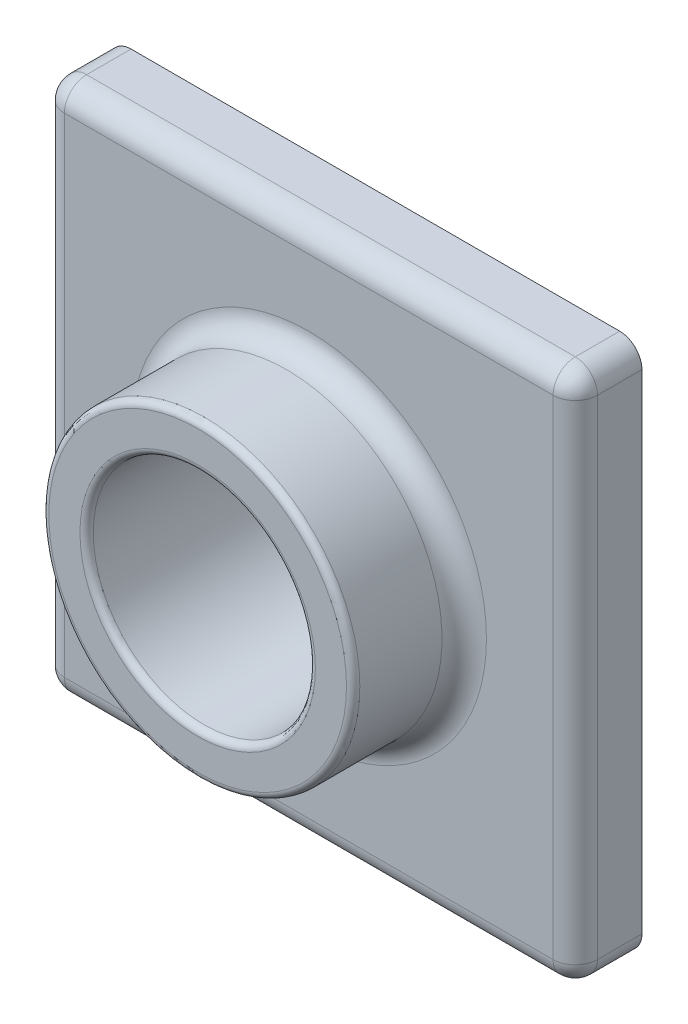
ISO-10303-21;
HEADER;
FILE_DESCRIPTION(('STEP AP214'),'2;1');
FILE_NAME('part.step','',(''),(''),'','','');
FILE_SCHEMA(('AUTOMOTIVE_DESIGN { 1 0 10303 214 1 1 1 1 }'));
ENDSEC;
DATA;
#1=APPLICATION_CONTEXT('core data for automotive mechanical design processes');
#2=APPLICATION_PROTOCOL_DEFINITION('international standard','automotive_design',2000,#1);
#3=PRODUCT_CONTEXT('',#1,'mechanical');
#4=PRODUCT('Part','Part','',(#3));
#5=PRODUCT_RELATED_PRODUCT_CATEGORY('part','',(#4));
#6=PRODUCT_DEFINITION_FORMATION('','',#4);
#7=PRODUCT_DEFINITION_CONTEXT('part definition',#1,'design');
#8=PRODUCT_DEFINITION('design','',#6,#7);
#9=PRODUCT_DEFINITION_SHAPE('','',#8);
#10=(LENGTH_UNIT() NAMED_UNIT(*) SI_UNIT(.MILLI.,.METRE.));
#11=(NAMED_UNIT(*) PLANE_ANGLE_UNIT() SI_UNIT($,.RADIAN.));
#12=(NAMED_UNIT(*) SI_UNIT($,.STERADIAN.) SOLID_ANGLE_UNIT());
#13=UNCERTAINTY_MEASURE_WITH_UNIT(LENGTH_MEASURE(1.E-05),#10,'distance_accuracy_value','');
#14=(GEOMETRIC_REPRESENTATION_CONTEXT(3) GLOBAL_UNCERTAINTY_ASSIGNED_CONTEXT((#13)) GLOBAL_UNIT_ASSIGNED_CONTEXT((#10,
#11,#12)) REPRESENTATION_CONTEXT('',''));
#15=CARTESIAN_POINT('',(0.,0.,0.));
#16=DIRECTION('',(0.,0.,1.));
#17=DIRECTION('',(1.,0.,0.));
#18=AXIS2_PLACEMENT_3D('',#15,#16,#17);
#19=CARTESIAN_POINT('',(0.,0.,0.));
#20=DIRECTION('',(0.,0.,-1.));
#21=DIRECTION('',(-1.,0.,0.));
#22=AXIS2_PLACEMENT_3D('',#19,#20,#21);
#23=PLANE('',#22);
#24=DIRECTION('',(1.,0.,0.));
#25=VECTOR('',#24,1.);
#26=CARTESIAN_POINT('',(0.,0.,0.));
#27=LINE('',#26,#25);
#28=CARTESIAN_POINT('',(5.,0.,0.));
#29=VERTEX_POINT('',#28);
#30=CARTESIAN_POINT('',(115.,0.,0.));
#31=VERTEX_POINT('',#30);
#32=EDGE_CURVE('E300',#29,#31,#27,.T.);
#33=ORIENTED_EDGE('',*,*,#32,.F.);
#34=CARTESIAN_POINT('',(5.,5.,0.));
#35=DIRECTION('',(0.,0.,-1.));
#36=DIRECTION('',(-1.,0.,0.));
#37=AXIS2_PLACEMENT_3D('',#34,#35,#36);
#38=CIRCLE('',#37,5.);
#39=CARTESIAN_POINT('',(0.,5.,0.));
#40=VERTEX_POINT('',#39);
#41=EDGE_CURVE('E354',#29,#40,#38,.T.);
#42=ORIENTED_EDGE('',*,*,#41,.T.);
#43=DIRECTION('',(0.,-1.,0.));
#44=VECTOR('',#43,1.);
#45=CARTESIAN_POINT('',(0.,0.,0.));
#46=LINE('',#45,#44);
#47=CARTESIAN_POINT('',(0.,115.,0.));
#48=VERTEX_POINT('',#47);
#49=EDGE_CURVE('E297',#48,#40,#46,.T.);
#50=ORIENTED_EDGE('',*,*,#49,.F.);
#51=CARTESIAN_POINT('',(5.,115.,0.));
#52=DIRECTION('',(0.,0.,-1.));
#53=DIRECTION('',(-1.,0.,0.));
#54=AXIS2_PLACEMENT_3D('',#51,#52,#53);
#55=CIRCLE('',#54,5.);
#56=CARTESIAN_POINT('',(5.,120.,0.));
#57=VERTEX_POINT('',#56);
#58=EDGE_CURVE('E348',#48,#57,#55,.T.);
#59=ORIENTED_EDGE('',*,*,#58,.T.);
#60=DIRECTION('',(-1.,0.,0.));
#61=VECTOR('',#60,1.);
#62=CARTESIAN_POINT('',(0.,120.,0.));
#63=LINE('',#62,#61);
#64=CARTESIAN_POINT('',(115.,120.,0.));
#65=VERTEX_POINT('',#64);
#66=EDGE_CURVE('E306',#65,#57,#63,.T.);
#67=ORIENTED_EDGE('',*,*,#66,.F.);
#68=CARTESIAN_POINT('',(115.,115.,0.));
#69=DIRECTION('',(0.,0.,-1.));
#70=DIRECTION('',(-1.,0.,0.));
#71=AXIS2_PLACEMENT_3D('',#68,#69,#70);
#72=CIRCLE('',#71,5.);
#73=CARTESIAN_POINT('',(120.,115.,0.));
#74=VERTEX_POINT('',#73);
#75=EDGE_CURVE('E350',#65,#74,#72,.T.);
#76=ORIENTED_EDGE('',*,*,#75,.T.);
#77=DIRECTION('',(0.,1.,0.));
#78=VECTOR('',#77,1.);
#79=CARTESIAN_POINT('',(120.,0.,0.));
#80=LINE('',#79,#78);
#81=CARTESIAN_POINT('',(120.,5.,0.));
#82=VERTEX_POINT('',#81);
#83=EDGE_CURVE('E303',#82,#74,#80,.T.);
#84=ORIENTED_EDGE('',*,*,#83,.F.);
#85=CARTESIAN_POINT('',(115.,5.,0.));
#86=DIRECTION('',(0.,0.,-1.));
#87=DIRECTION('',(-1.,0.,0.));
#88=AXIS2_PLACEMENT_3D('',#85,#86,#87);
#89=CIRCLE('',#88,5.);
#90=EDGE_CURVE('E352',#82,#31,#89,.T.);
#91=ORIENTED_EDGE('',*,*,#90,.T.);
#92=EDGE_LOOP('',(#33,#42,#50,#59,#67,#76,#84,#91));
#93=FACE_BOUND('',#92,.T.);
#94=CARTESIAN_POINT('',(5.,5.,0.));
#95=DIRECTION('',(0.,0.,-1.));
#96=DIRECTION('',(-1.,0.,0.));
#97=AXIS2_PLACEMENT_3D('',#94,#95,#96);
#98=CIRCLE('',#97,3.);
#99=CARTESIAN_POINT('',(5.,2.,0.));
#100=VERTEX_POINT('',#99);
#101=CARTESIAN_POINT('',(2.,5.,0.));
#102=VERTEX_POINT('',#101);
#103=EDGE_CURVE('E227',#100,#102,#98,.T.);
#104=ORIENTED_EDGE('',*,*,#103,.F.);
#105=DIRECTION('',(1.,0.,0.));
#106=VECTOR('',#105,1.);
#107=CARTESIAN_POINT('',(0.,2.,0.));
#108=LINE('',#107,#106);
#109=CARTESIAN_POINT('',(115.,2.,0.));
#110=VERTEX_POINT('',#109);
#111=EDGE_CURVE('E280',#100,#110,#108,.T.);
#112=ORIENTED_EDGE('',*,*,#111,.T.);
#113=CARTESIAN_POINT('',(115.,5.,0.));
#114=DIRECTION('',(0.,0.,-1.));
#115=DIRECTION('',(-1.,0.,0.));
#116=AXIS2_PLACEMENT_3D('',#113,#114,#115);
#117=CIRCLE('',#116,3.);
#118=CARTESIAN_POINT('',(118.,5.,0.));
#119=VERTEX_POINT('',#118);
#120=EDGE_CURVE('E284',#119,#110,#117,.T.);
#121=ORIENTED_EDGE('',*,*,#120,.F.);
#122=DIRECTION('',(0.,1.,0.));
#123=VECTOR('',#122,1.);
#124=CARTESIAN_POINT('',(118.,0.,0.));
#125=LINE('',#124,#123);
#126=CARTESIAN_POINT('',(118.,115.,0.));
#127=VERTEX_POINT('',#126);
#128=EDGE_CURVE('E51',#119,#127,#125,.T.);
#129=ORIENTED_EDGE('',*,*,#128,.T.);
#130=CARTESIAN_POINT('',(115.,115.,0.));
#131=DIRECTION('',(0.,0.,-1.));
#132=DIRECTION('',(-1.,0.,0.));
#133=AXIS2_PLACEMENT_3D('',#130,#131,#132);
#134=CIRCLE('',#133,3.);
#135=CARTESIAN_POINT('',(115.,118.,0.));
#136=VERTEX_POINT('',#135);
#137=EDGE_CURVE('E288',#136,#127,#134,.T.);
#138=ORIENTED_EDGE('',*,*,#137,.F.);
#139=DIRECTION('',(-1.,0.,0.));
#140=VECTOR('',#139,1.);
#141=CARTESIAN_POINT('',(0.,118.,0.));
#142=LINE('',#141,#140);
#143=CARTESIAN_POINT('',(5.,118.,0.));
#144=VERTEX_POINT('',#143);
#145=EDGE_CURVE('E222',#136,#144,#142,.T.);
#146=ORIENTED_EDGE('',*,*,#145,.T.);
#147=CARTESIAN_POINT('',(5.,115.,0.));
#148=DIRECTION('',(0.,0.,-1.));
#149=DIRECTION('',(-1.,0.,0.));
#150=AXIS2_PLACEMENT_3D('',#147,#148,#149);
#151=CIRCLE('',#150,3.);
#152=CARTESIAN_POINT('',(2.,115.,0.));
#153=VERTEX_POINT('',#152);
#154=EDGE_CURVE('E268',#153,#144,#151,.T.);
#155=ORIENTED_EDGE('',*,*,#154,.F.);
#156=DIRECTION('',(0.,-1.,0.));
#157=VECTOR('',#156,1.);
#158=CARTESIAN_POINT('',(2.,0.,0.));
#159=LINE('',#158,#157);
#160=EDGE_CURVE('E279',#153,#102,#159,.T.);
#161=ORIENTED_EDGE('',*,*,#160,.T.);
#162=EDGE_LOOP('',(#104,#112,#121,#129,#138,#146,#155,#161));
#163=FACE_BOUND('',#162,.T.);
#164=ADVANCED_FACE('F36',(#93,#163),#23,.T.);
#165=CARTESIAN_POINT('',(0.,0.,15.));
#166=DIRECTION('',(0.,0.,-1.));
#167=DIRECTION('',(-1.,0.,0.));
#168=AXIS2_PLACEMENT_3D('',#165,#166,#167);
#169=PLANE('',#168);
#170=CARTESIAN_POINT('',(60.,60.,15.));
#171=DIRECTION('',(0.,0.,-1.));
#172=DIRECTION('',(-1.,0.,0.));
#173=AXIS2_PLACEMENT_3D('',#170,#171,#172);
#174=CIRCLE('',#173,40.);
#175=CARTESIAN_POINT('',(20.,60.,15.));
#176=VERTEX_POINT('',#175);
#177=EDGE_CURVE('E321',#176,#176,#174,.T.);
#178=ORIENTED_EDGE('',*,*,#177,.T.);
#179=EDGE_LOOP('',(#178));
#180=FACE_BOUND('',#179,.T.);
#181=DIRECTION('',(0.,1.,0.));
#182=VECTOR('',#181,1.);
#183=CARTESIAN_POINT('',(115.,0.,15.));
#184=LINE('',#183,#182);
#185=CARTESIAN_POINT('',(115.,5.,15.));
#186=VERTEX_POINT('',#185);
#187=CARTESIAN_POINT('',(115.,115.,15.));
#188=VERTEX_POINT('',#187);
#189=EDGE_CURVE('E316',#186,#188,#184,.T.);
#190=ORIENTED_EDGE('',*,*,#189,.T.);
#191=DIRECTION('',(-1.,0.,0.));
#192=VECTOR('',#191,1.);
#193=CARTESIAN_POINT('',(0.,115.,15.));
#194=LINE('',#193,#192);
#195=CARTESIAN_POINT('',(5.,115.,15.));
#196=VERTEX_POINT('',#195);
#197=EDGE_CURVE('E318',#188,#196,#194,.T.);
#198=ORIENTED_EDGE('',*,*,#197,.T.);
#199=DIRECTION('',(0.,-1.,0.));
#200=VECTOR('',#199,1.);
#201=CARTESIAN_POINT('',(5.,0.,15.));
#202=LINE('',#201,#200);
#203=CARTESIAN_POINT('',(5.,5.,15.));
#204=VERTEX_POINT('',#203);
#205=EDGE_CURVE('E312',#196,#204,#202,.T.);
#206=ORIENTED_EDGE('',*,*,#205,.T.);
#207=DIRECTION('',(1.,0.,0.));
#208=VECTOR('',#207,1.);
#209=CARTESIAN_POINT('',(0.,5.,15.));
#210=LINE('',#209,#208);
#211=EDGE_CURVE('E314',#204,#186,#210,.T.);
#212=ORIENTED_EDGE('',*,*,#211,.T.);
#213=EDGE_LOOP('',(#190,#198,#206,#212));
#214=FACE_BOUND('',#213,.T.);
#215=ADVANCED_FACE('F438',(#180,#214),#169,.F.);
#216=CARTESIAN_POINT('',(0.,0.,15.));
#217=DIRECTION('',(1.,0.,0.));
#218=DIRECTION('',(0.,0.,-1.));
#219=AXIS2_PLACEMENT_3D('',#216,#217,#218);
#220=PLANE('',#219);
#221=ORIENTED_EDGE('',*,*,#49,.T.);
#222=DIRECTION('',(0.,0.,-1.));
#223=VECTOR('',#222,1.);
#224=CARTESIAN_POINT('',(0.,5.,15.));
#225=LINE('',#224,#223);
#226=CARTESIAN_POINT('',(0.,5.,10.));
#227=VERTEX_POINT('',#226);
#228=EDGE_CURVE('E59',#40,#227,#225,.F.);
#229=ORIENTED_EDGE('',*,*,#228,.T.);
#230=DIRECTION('',(0.,-1.,0.));
#231=VECTOR('',#230,1.);
#232=CARTESIAN_POINT('',(0.,0.,10.));
#233=LINE('',#232,#231);
#234=CARTESIAN_POINT('',(0.,115.,10.));
#235=VERTEX_POINT('',#234);
#236=EDGE_CURVE('E345',#227,#235,#233,.F.);
#237=ORIENTED_EDGE('',*,*,#236,.T.);
#238=DIRECTION('',(0.,0.,-1.));
#239=VECTOR('',#238,1.);
#240=CARTESIAN_POINT('',(0.,115.,15.));
#241=LINE('',#240,#239);
#242=EDGE_CURVE('E343',#235,#48,#241,.T.);
#243=ORIENTED_EDGE('',*,*,#242,.T.);
#244=EDGE_LOOP('',(#221,#229,#237,#243));
#245=FACE_BOUND('',#244,.T.);
#246=ADVANCED_FACE('F443',(#245),#220,.F.);
#247=CARTESIAN_POINT('',(0.,0.,15.));
#248=DIRECTION('',(0.,1.,0.));
#249=DIRECTION('',(0.,0.,1.));
#250=AXIS2_PLACEMENT_3D('',#247,#248,#249);
#251=PLANE('',#250);
#252=DIRECTION('',(1.,0.,0.));
#253=VECTOR('',#252,1.);
#254=CARTESIAN_POINT('',(0.,0.,10.));
#255=LINE('',#254,#253);
#256=CARTESIAN_POINT('',(115.,0.,10.));
#257=VERTEX_POINT('',#256);
#258=CARTESIAN_POINT('',(5.,0.,10.));
#259=VERTEX_POINT('',#258);
#260=EDGE_CURVE('E339',#257,#259,#255,.F.);
#261=ORIENTED_EDGE('',*,*,#260,.T.);
#262=DIRECTION('',(0.,0.,-1.));
#263=VECTOR('',#262,1.);
#264=CARTESIAN_POINT('',(5.,0.,15.));
#265=LINE('',#264,#263);
#266=EDGE_CURVE('E341',#259,#29,#265,.T.);
#267=ORIENTED_EDGE('',*,*,#266,.T.);
#268=ORIENTED_EDGE('',*,*,#32,.T.);
#269=DIRECTION('',(0.,0.,-1.));
#270=VECTOR('',#269,1.);
#271=CARTESIAN_POINT('',(115.,0.,15.));
#272=LINE('',#271,#270);
#273=EDGE_CURVE('E337',#31,#257,#272,.F.);
#274=ORIENTED_EDGE('',*,*,#273,.T.);
#275=EDGE_LOOP('',(#261,#267,#268,#274));
#276=FACE_BOUND('',#275,.T.);
#277=ADVANCED_FACE('F817',(#276),#251,.F.);
#278=CARTESIAN_POINT('',(120.,0.,15.));
#279=DIRECTION('',(-1.,0.,0.));
#280=DIRECTION('',(0.,0.,1.));
#281=AXIS2_PLACEMENT_3D('',#278,#279,#280);
#282=PLANE('',#281);
#283=DIRECTION('',(0.,1.,0.));
#284=VECTOR('',#283,1.);
#285=CARTESIAN_POINT('',(120.,0.,10.));
#286=LINE('',#285,#284);
#287=CARTESIAN_POINT('',(120.,115.,10.));
#288=VERTEX_POINT('',#287);
#289=CARTESIAN_POINT('',(120.,5.,10.));
#290=VERTEX_POINT('',#289);
#291=EDGE_CURVE('E333',#288,#290,#286,.F.);
#292=ORIENTED_EDGE('',*,*,#291,.T.);
#293=DIRECTION('',(0.,0.,-1.));
#294=VECTOR('',#293,1.);
#295=CARTESIAN_POINT('',(120.,5.,15.));
#296=LINE('',#295,#294);
#297=EDGE_CURVE('E335',#290,#82,#296,.T.);
#298=ORIENTED_EDGE('',*,*,#297,.T.);
#299=ORIENTED_EDGE('',*,*,#83,.T.);
#300=DIRECTION('',(0.,0.,-1.));
#301=VECTOR('',#300,1.);
#302=CARTESIAN_POINT('',(120.,115.,15.));
#303=LINE('',#302,#301);
#304=EDGE_CURVE('E331',#74,#288,#303,.F.);
#305=ORIENTED_EDGE('',*,*,#304,.T.);
#306=EDGE_LOOP('',(#292,#298,#299,#305));
#307=FACE_BOUND('',#306,.T.);
#308=ADVANCED_FACE('F432',(#307),#282,.F.);
#309=CARTESIAN_POINT('',(0.,120.,15.));
#310=DIRECTION('',(0.,-1.,0.));
#311=DIRECTION('',(0.,0.,-1.));
#312=AXIS2_PLACEMENT_3D('',#309,#310,#311);
#313=PLANE('',#312);
#314=DIRECTION('',(-1.,0.,0.));
#315=VECTOR('',#314,1.);
#316=CARTESIAN_POINT('',(0.,120.,10.));
#317=LINE('',#316,#315);
#318=CARTESIAN_POINT('',(5.,120.,10.));
#319=VERTEX_POINT('',#318);
#320=CARTESIAN_POINT('',(115.,120.,10.));
#321=VERTEX_POINT('',#320);
#322=EDGE_CURVE('E326',#319,#321,#317,.F.);
#323=ORIENTED_EDGE('',*,*,#322,.T.);
#324=DIRECTION('',(0.,0.,-1.));
#325=VECTOR('',#324,1.);
#326=CARTESIAN_POINT('',(115.,120.,15.));
#327=LINE('',#326,#325);
#328=EDGE_CURVE('E329',#321,#65,#327,.T.);
#329=ORIENTED_EDGE('',*,*,#328,.T.);
#330=ORIENTED_EDGE('',*,*,#66,.T.);
#331=DIRECTION('',(0.,0.,-1.));
#332=VECTOR('',#331,1.);
#333=CARTESIAN_POINT('',(5.,120.,15.));
#334=LINE('',#333,#332);
#335=EDGE_CURVE('E324',#57,#319,#334,.F.);
#336=ORIENTED_EDGE('',*,*,#335,.T.);
#337=EDGE_LOOP('',(#323,#329,#330,#336));
#338=FACE_BOUND('',#337,.T.);
#339=ADVANCED_FACE('F424',(#338),#313,.F.);
#340=CARTESIAN_POINT('',(60.,60.,0.));
#341=DIRECTION('',(0.,0.,-1.));
#342=DIRECTION('',(-1.,0.,0.));
#343=AXIS2_PLACEMENT_3D('',#340,#341,#342);
#344=CIRCLE('',#343,27.);
#345=CARTESIAN_POINT('',(33.,60.,0.));
#346=VERTEX_POINT('',#345);
#347=EDGE_CURVE('E251',#346,#346,#344,.F.);
#348=ORIENTED_EDGE('',*,*,#347,.F.);
#349=EDGE_LOOP('',(#348));
#350=FACE_BOUND('',#349,.T.);
#351=CARTESIAN_POINT('',(60.,60.,0.));
#352=DIRECTION('',(0.,0.,1.));
#353=DIRECTION('',(1.,0.,0.));
#354=AXIS2_PLACEMENT_3D('',#351,#352,#353);
#355=CIRCLE('',#354,25.);
#356=CARTESIAN_POINT('',(85.,60.,0.));
#357=VERTEX_POINT('',#356);
#358=EDGE_CURVE('E294',#357,#357,#355,.T.);
#359=ORIENTED_EDGE('',*,*,#358,.T.);
#360=EDGE_LOOP('',(#359));
#361=FACE_BOUND('',#360,.T.);
#362=ADVANCED_FACE('F422',(#350,#361),#23,.T.);
#363=CARTESIAN_POINT('',(60.,60.,40.));
#364=DIRECTION('',(0.,0.,-1.));
#365=DIRECTION('',(-1.,0.,0.));
#366=AXIS2_PLACEMENT_3D('',#363,#364,#365);
#367=CYLINDRICAL_SURFACE('',#366,35.);
#368=CARTESIAN_POINT('',(60.,60.,38.5));
#369=DIRECTION('',(0.,0.,1.));
#370=DIRECTION('',(1.,0.,0.));
#371=AXIS2_PLACEMENT_3D('',#368,#369,#370);
#372=CIRCLE('',#371,35.);
#373=CARTESIAN_POINT('',(95.,60.,38.5));
#374=VERTEX_POINT('',#373);
#375=EDGE_CURVE('E44',#374,#374,#372,.F.);
#376=ORIENTED_EDGE('',*,*,#375,.T.);
#377=EDGE_LOOP('',(#376));
#378=FACE_BOUND('',#377,.T.);
#379=CARTESIAN_POINT('',(60.,60.,20.));
#380=DIRECTION('',(0.,0.,-1.));
#381=DIRECTION('',(-1.,0.,0.));
#382=AXIS2_PLACEMENT_3D('',#379,#380,#381);
#383=CIRCLE('',#382,35.);
#384=CARTESIAN_POINT('',(25.,60.,20.));
#385=VERTEX_POINT('',#384);
#386=EDGE_CURVE('E309',#385,#385,#383,.F.);
#387=ORIENTED_EDGE('',*,*,#386,.T.);
#388=EDGE_LOOP('',(#387));
#389=FACE_BOUND('',#388,.T.);
#390=ADVANCED_FACE('F396',(#378,#389),#367,.T.);
#391=CARTESIAN_POINT('',(60.,60.,40.));
#392=DIRECTION('',(0.,0.,1.));
#393=DIRECTION('',(1.,0.,0.));
#394=AXIS2_PLACEMENT_3D('',#391,#392,#393);
#395=PLANE('',#394);
#396=CARTESIAN_POINT('',(60.,60.,40.));
#397=DIRECTION('',(0.,0.,1.));
#398=DIRECTION('',(1.,0.,0.));
#399=AXIS2_PLACEMENT_3D('',#396,#397,#398);
#400=CIRCLE('',#399,33.5);
#401=CARTESIAN_POINT('',(93.5,60.,40.));
#402=VERTEX_POINT('',#401);
#403=EDGE_CURVE('E391',#402,#402,#400,.T.);
#404=ORIENTED_EDGE('',*,*,#403,.T.);
#405=EDGE_LOOP('',(#404));
#406=FACE_BOUND('',#405,.T.);
#407=CARTESIAN_POINT('',(60.,60.,40.));
#408=DIRECTION('',(0.,0.,1.));
#409=DIRECTION('',(1.,0.,0.));
#410=AXIS2_PLACEMENT_3D('',#407,#408,#409);
#411=CIRCLE('',#410,26.5);
#412=CARTESIAN_POINT('',(86.5,60.,40.));
#413=VERTEX_POINT('',#412);
#414=EDGE_CURVE('E356',#413,#413,#411,.F.);
#415=ORIENTED_EDGE('',*,*,#414,.T.);
#416=EDGE_LOOP('',(#415));
#417=FACE_BOUND('',#416,.T.);
#418=ADVANCED_FACE('F405',(#406,#417),#395,.T.);
#419=CARTESIAN_POINT('',(60.,60.,0.));
#420=DIRECTION('',(0.,0.,1.));
#421=DIRECTION('',(1.,0.,0.));
#422=AXIS2_PLACEMENT_3D('',#419,#420,#421);
#423=CYLINDRICAL_SURFACE('',#422,25.);
#424=CARTESIAN_POINT('',(60.,60.,38.5));
#425=DIRECTION('',(0.,0.,1.));
#426=DIRECTION('',(1.,0.,0.));
#427=AXIS2_PLACEMENT_3D('',#424,#425,#426);
#428=CIRCLE('',#427,25.);
#429=CARTESIAN_POINT('',(85.,60.,38.5));
#430=VERTEX_POINT('',#429);
#431=EDGE_CURVE('E11',#430,#430,#428,.T.);
#432=ORIENTED_EDGE('',*,*,#431,.T.);
#433=EDGE_LOOP('',(#432));
#434=FACE_BOUND('',#433,.T.);
#435=ORIENTED_EDGE('',*,*,#358,.F.);
#436=EDGE_LOOP('',(#435));
#437=FACE_BOUND('',#436,.T.);
#438=ADVANCED_FACE('F408',(#434,#437),#423,.F.);
#439=CARTESIAN_POINT('',(60.,60.,20.));
#440=DIRECTION('',(0.,0.,-1.));
#441=DIRECTION('',(-1.,0.,0.));
#442=AXIS2_PLACEMENT_3D('',#439,#440,#441);
#443=TOROIDAL_SURFACE('',#442,40.,5.);
#444=ORIENTED_EDGE('',*,*,#177,.F.);
#445=EDGE_LOOP('',(#444));
#446=FACE_BOUND('',#445,.T.);
#447=ORIENTED_EDGE('',*,*,#386,.F.);
#448=EDGE_LOOP('',(#447));
#449=FACE_BOUND('',#448,.T.);
#450=ADVANCED_FACE('F418',(#446,#449),#443,.F.);
#451=CARTESIAN_POINT('',(115.,5.,15.));
#452=DIRECTION('',(0.,0.,-1.));
#453=DIRECTION('',(-1.,0.,0.));
#454=AXIS2_PLACEMENT_3D('',#451,#452,#453);
#455=CYLINDRICAL_SURFACE('',#454,5.);
#456=ORIENTED_EDGE('',*,*,#90,.F.);
#457=ORIENTED_EDGE('',*,*,#297,.F.);
#458=CARTESIAN_POINT('',(115.,5.,10.));
#459=DIRECTION('',(0.,0.,1.));
#460=DIRECTION('',(1.,0.,0.));
#461=AXIS2_PLACEMENT_3D('',#458,#459,#460);
#462=CIRCLE('',#461,5.);
#463=EDGE_CURVE('E298',#257,#290,#462,.T.);
#464=ORIENTED_EDGE('',*,*,#463,.F.);
#465=ORIENTED_EDGE('',*,*,#273,.F.);
#466=EDGE_LOOP('',(#456,#457,#464,#465));
#467=FACE_BOUND('',#466,.T.);
#468=ADVANCED_FACE('F786',(#467),#455,.T.);
#469=CARTESIAN_POINT('',(0.,5.,10.));
#470=DIRECTION('',(1.,0.,0.));
#471=DIRECTION('',(0.,0.,-1.));
#472=AXIS2_PLACEMENT_3D('',#469,#470,#471);
#473=CYLINDRICAL_SURFACE('',#472,5.);
#474=CARTESIAN_POINT('',(5.,5.,10.));
#475=DIRECTION('',(-1.,0.,0.));
#476=DIRECTION('',(0.,0.,1.));
#477=AXIS2_PLACEMENT_3D('',#474,#475,#476);
#478=CIRCLE('',#477,5.);
#479=EDGE_CURVE('E381',#259,#204,#478,.T.);
#480=ORIENTED_EDGE('',*,*,#479,.F.);
#481=ORIENTED_EDGE('',*,*,#260,.F.);
#482=CARTESIAN_POINT('',(115.,5.,10.));
#483=DIRECTION('',(1.,0.,0.));
#484=DIRECTION('',(0.,0.,-1.));
#485=AXIS2_PLACEMENT_3D('',#482,#483,#484);
#486=CIRCLE('',#485,5.);
#487=EDGE_CURVE('E384',#186,#257,#486,.T.);
#488=ORIENTED_EDGE('',*,*,#487,.F.);
#489=ORIENTED_EDGE('',*,*,#211,.F.);
#490=EDGE_LOOP('',(#480,#481,#488,#489));
#491=FACE_BOUND('',#490,.T.);
#492=ADVANCED_FACE('F776',(#491),#473,.T.);
#493=CARTESIAN_POINT('',(5.,5.,15.));
#494=DIRECTION('',(0.,0.,-1.));
#495=DIRECTION('',(-1.,0.,0.));
#496=AXIS2_PLACEMENT_3D('',#493,#494,#495);
#497=CYLINDRICAL_SURFACE('',#496,5.);
#498=ORIENTED_EDGE('',*,*,#41,.F.);
#499=ORIENTED_EDGE('',*,*,#266,.F.);
#500=CARTESIAN_POINT('',(5.,5.,10.));
#501=DIRECTION('',(0.,0.,1.));
#502=DIRECTION('',(1.,0.,0.));
#503=AXIS2_PLACEMENT_3D('',#500,#501,#502);
#504=CIRCLE('',#503,5.);
#505=EDGE_CURVE('E378',#227,#259,#504,.T.);
#506=ORIENTED_EDGE('',*,*,#505,.F.);
#507=ORIENTED_EDGE('',*,*,#228,.F.);
#508=EDGE_LOOP('',(#498,#499,#506,#507));
#509=FACE_BOUND('',#508,.T.);
#510=ADVANCED_FACE('F766',(#509),#497,.T.);
#511=CARTESIAN_POINT('',(115.,5.,10.));
#512=DIRECTION('',(0.,0.,1.));
#513=DIRECTION('',(1.,0.,0.));
#514=AXIS2_PLACEMENT_3D('',#511,#512,#513);
#515=SPHERICAL_SURFACE('',#514,5.);
#516=ORIENTED_EDGE('',*,*,#487,.T.);
#517=ORIENTED_EDGE('',*,*,#463,.T.);
#518=CARTESIAN_POINT('',(115.,5.,10.));
#519=DIRECTION('',(0.,-1.,0.));
#520=DIRECTION('',(0.,0.,-1.));
#521=AXIS2_PLACEMENT_3D('',#518,#519,#520);
#522=CIRCLE('',#521,5.);
#523=EDGE_CURVE('E375',#186,#290,#522,.F.);
#524=ORIENTED_EDGE('',*,*,#523,.F.);
#525=EDGE_LOOP('',(#516,#517,#524));
#526=FACE_BOUND('',#525,.T.);
#527=ADVANCED_FACE('F756',(#526),#515,.T.);
#528=CARTESIAN_POINT('',(5.,5.,10.));
#529=DIRECTION('',(0.,0.,1.));
#530=DIRECTION('',(1.,0.,0.));
#531=AXIS2_PLACEMENT_3D('',#528,#529,#530);
#532=SPHERICAL_SURFACE('',#531,5.);
#533=ORIENTED_EDGE('',*,*,#505,.T.);
#534=ORIENTED_EDGE('',*,*,#479,.T.);
#535=CARTESIAN_POINT('',(5.,5.,10.));
#536=DIRECTION('',(0.,-1.,0.));
#537=DIRECTION('',(0.,0.,-1.));
#538=AXIS2_PLACEMENT_3D('',#535,#536,#537);
#539=CIRCLE('',#538,5.);
#540=EDGE_CURVE('E372',#227,#204,#539,.F.);
#541=ORIENTED_EDGE('',*,*,#540,.F.);
#542=EDGE_LOOP('',(#533,#534,#541));
#543=FACE_BOUND('',#542,.T.);
#544=ADVANCED_FACE('F746',(#543),#532,.T.);
#545=CARTESIAN_POINT('',(115.,115.,15.));
#546=DIRECTION('',(0.,0.,-1.));
#547=DIRECTION('',(-1.,0.,0.));
#548=AXIS2_PLACEMENT_3D('',#545,#546,#547);
#549=CYLINDRICAL_SURFACE('',#548,5.);
#550=ORIENTED_EDGE('',*,*,#75,.F.);
#551=ORIENTED_EDGE('',*,*,#328,.F.);
#552=CARTESIAN_POINT('',(115.,115.,10.));
#553=DIRECTION('',(0.,0.,1.));
#554=DIRECTION('',(1.,0.,0.));
#555=AXIS2_PLACEMENT_3D('',#552,#553,#554);
#556=CIRCLE('',#555,5.);
#557=EDGE_CURVE('E369',#288,#321,#556,.T.);
#558=ORIENTED_EDGE('',*,*,#557,.F.);
#559=ORIENTED_EDGE('',*,*,#304,.F.);
#560=EDGE_LOOP('',(#550,#551,#558,#559));
#561=FACE_BOUND('',#560,.T.);
#562=ADVANCED_FACE('F736',(#561),#549,.T.);
#563=CARTESIAN_POINT('',(115.,0.,10.));
#564=DIRECTION('',(0.,1.,0.));
#565=DIRECTION('',(0.,0.,1.));
#566=AXIS2_PLACEMENT_3D('',#563,#564,#565);
#567=CYLINDRICAL_SURFACE('',#566,5.);
#568=ORIENTED_EDGE('',*,*,#523,.T.);
#569=ORIENTED_EDGE('',*,*,#291,.F.);
#570=CARTESIAN_POINT('',(115.,115.,10.));
#571=DIRECTION('',(0.,1.,0.));
#572=DIRECTION('',(0.,0.,1.));
#573=AXIS2_PLACEMENT_3D('',#570,#571,#572);
#574=CIRCLE('',#573,5.);
#575=EDGE_CURVE('E366',#188,#288,#574,.T.);
#576=ORIENTED_EDGE('',*,*,#575,.F.);
#577=ORIENTED_EDGE('',*,*,#189,.F.);
#578=EDGE_LOOP('',(#568,#569,#576,#577));
#579=FACE_BOUND('',#578,.T.);
#580=ADVANCED_FACE('F726',(#579),#567,.T.);
#581=CARTESIAN_POINT('',(5.,0.,10.));
#582=DIRECTION('',(0.,-1.,0.));
#583=DIRECTION('',(0.,0.,-1.));
#584=AXIS2_PLACEMENT_3D('',#581,#582,#583);
#585=CYLINDRICAL_SURFACE('',#584,5.);
#586=ORIENTED_EDGE('',*,*,#540,.T.);
#587=ORIENTED_EDGE('',*,*,#205,.F.);
#588=CARTESIAN_POINT('',(5.,115.,10.));
#589=DIRECTION('',(0.,1.,0.));
#590=DIRECTION('',(0.,0.,1.));
#591=AXIS2_PLACEMENT_3D('',#588,#589,#590);
#592=CIRCLE('',#591,5.);
#593=EDGE_CURVE('E363',#235,#196,#592,.T.);
#594=ORIENTED_EDGE('',*,*,#593,.F.);
#595=ORIENTED_EDGE('',*,*,#236,.F.);
#596=EDGE_LOOP('',(#586,#587,#594,#595));
#597=FACE_BOUND('',#596,.T.);
#598=ADVANCED_FACE('F716',(#597),#585,.T.);
#599=CARTESIAN_POINT('',(5.,115.,15.));
#600=DIRECTION('',(0.,0.,-1.));
#601=DIRECTION('',(-1.,0.,0.));
#602=AXIS2_PLACEMENT_3D('',#599,#600,#601);
#603=CYLINDRICAL_SURFACE('',#602,5.);
#604=ORIENTED_EDGE('',*,*,#58,.F.);
#605=ORIENTED_EDGE('',*,*,#242,.F.);
#606=CARTESIAN_POINT('',(5.,115.,10.));
#607=DIRECTION('',(0.,0.,1.));
#608=DIRECTION('',(1.,0.,0.));
#609=AXIS2_PLACEMENT_3D('',#606,#607,#608);
#610=CIRCLE('',#609,5.);
#611=EDGE_CURVE('E360',#319,#235,#610,.T.);
#612=ORIENTED_EDGE('',*,*,#611,.F.);
#613=ORIENTED_EDGE('',*,*,#335,.F.);
#614=EDGE_LOOP('',(#604,#605,#612,#613));
#615=FACE_BOUND('',#614,.T.);
#616=ADVANCED_FACE('F706',(#615),#603,.T.);
#617=CARTESIAN_POINT('',(115.,115.,10.));
#618=DIRECTION('',(0.,0.,1.));
#619=DIRECTION('',(1.,0.,0.));
#620=AXIS2_PLACEMENT_3D('',#617,#618,#619);
#621=SPHERICAL_SURFACE('',#620,5.);
#622=ORIENTED_EDGE('',*,*,#575,.T.);
#623=ORIENTED_EDGE('',*,*,#557,.T.);
#624=CARTESIAN_POINT('',(115.,115.,10.));
#625=DIRECTION('',(1.,0.,0.));
#626=DIRECTION('',(0.,0.,-1.));
#627=AXIS2_PLACEMENT_3D('',#624,#625,#626);
#628=CIRCLE('',#627,5.);
#629=EDGE_CURVE('E358',#188,#321,#628,.F.);
#630=ORIENTED_EDGE('',*,*,#629,.F.);
#631=EDGE_LOOP('',(#622,#623,#630));
#632=FACE_BOUND('',#631,.T.);
#633=ADVANCED_FACE('F696',(#632),#621,.T.);
#634=CARTESIAN_POINT('',(5.,115.,10.));
#635=DIRECTION('',(0.,0.,1.));
#636=DIRECTION('',(1.,0.,0.));
#637=AXIS2_PLACEMENT_3D('',#634,#635,#636);
#638=SPHERICAL_SURFACE('',#637,5.);
#639=ORIENTED_EDGE('',*,*,#611,.T.);
#640=ORIENTED_EDGE('',*,*,#593,.T.);
#641=CARTESIAN_POINT('',(5.,115.,10.));
#642=DIRECTION('',(-1.,0.,0.));
#643=DIRECTION('',(0.,0.,1.));
#644=AXIS2_PLACEMENT_3D('',#641,#642,#643);
#645=CIRCLE('',#644,5.);
#646=EDGE_CURVE('E230',#319,#196,#645,.F.);
#647=ORIENTED_EDGE('',*,*,#646,.F.);
#648=EDGE_LOOP('',(#639,#640,#647));
#649=FACE_BOUND('',#648,.T.);
#650=ADVANCED_FACE('F686',(#649),#638,.T.);
#651=CARTESIAN_POINT('',(0.,115.,10.));
#652=DIRECTION('',(-1.,0.,0.));
#653=DIRECTION('',(0.,0.,1.));
#654=AXIS2_PLACEMENT_3D('',#651,#652,#653);
#655=CYLINDRICAL_SURFACE('',#654,5.);
#656=ORIENTED_EDGE('',*,*,#629,.T.);
#657=ORIENTED_EDGE('',*,*,#322,.F.);
#658=ORIENTED_EDGE('',*,*,#646,.T.);
#659=ORIENTED_EDGE('',*,*,#197,.F.);
#660=EDGE_LOOP('',(#656,#657,#658,#659));
#661=FACE_BOUND('',#660,.T.);
#662=ADVANCED_FACE('F402',(#661),#655,.T.);
#663=CARTESIAN_POINT('',(60.,60.,38.5));
#664=DIRECTION('',(0.,0.,1.));
#665=DIRECTION('',(1.,0.,0.));
#666=AXIS2_PLACEMENT_3D('',#663,#664,#665);
#667=TOROIDAL_SURFACE('',#666,33.5,1.5);
#668=ORIENTED_EDGE('',*,*,#375,.F.);
#669=EDGE_LOOP('',(#668));
#670=FACE_BOUND('',#669,.T.);
#671=ORIENTED_EDGE('',*,*,#403,.F.);
#672=EDGE_LOOP('',(#671));
#673=FACE_BOUND('',#672,.T.);
#674=ADVANCED_FACE('F399',(#670,#673),#667,.T.);
#675=CARTESIAN_POINT('',(60.,60.,38.5));
#676=DIRECTION('',(0.,0.,1.));
#677=DIRECTION('',(1.,0.,0.));
#678=AXIS2_PLACEMENT_3D('',#675,#676,#677);
#679=TOROIDAL_SURFACE('',#678,26.5,1.5);
#680=ORIENTED_EDGE('',*,*,#414,.F.);
#681=EDGE_LOOP('',(#680));
#682=FACE_BOUND('',#681,.T.);
#683=ORIENTED_EDGE('',*,*,#431,.F.);
#684=EDGE_LOOP('',(#683));
#685=FACE_BOUND('',#684,.T.);
#686=ADVANCED_FACE('F38',(#682,#685),#679,.T.);
#687=CARTESIAN_POINT('',(0.,0.,13.));
#688=DIRECTION('',(0.,0.,-1.));
#689=DIRECTION('',(-1.,0.,0.));
#690=AXIS2_PLACEMENT_3D('',#687,#688,#689);
#691=PLANE('',#690);
#692=CARTESIAN_POINT('',(60.,60.,13.));
#693=DIRECTION('',(0.,0.,-1.));
#694=DIRECTION('',(-1.,0.,0.));
#695=AXIS2_PLACEMENT_3D('',#692,#693,#694);
#696=CIRCLE('',#695,40.);
#697=CARTESIAN_POINT('',(20.,60.,13.));
#698=VERTEX_POINT('',#697);
#699=EDGE_CURVE('E211',#698,#698,#696,.T.);
#700=ORIENTED_EDGE('',*,*,#699,.F.);
#701=EDGE_LOOP('',(#700));
#702=FACE_BOUND('',#701,.T.);
#703=DIRECTION('',(0.,1.,0.));
#704=VECTOR('',#703,1.);
#705=CARTESIAN_POINT('',(115.,0.,13.));
#706=LINE('',#705,#704);
#707=CARTESIAN_POINT('',(115.,5.,13.));
#708=VERTEX_POINT('',#707);
#709=CARTESIAN_POINT('',(115.,115.,13.));
#710=VERTEX_POINT('',#709);
#711=EDGE_CURVE('E177',#708,#710,#706,.T.);
#712=ORIENTED_EDGE('',*,*,#711,.F.);
#713=DIRECTION('',(-1.,0.,0.));
#714=VECTOR('',#713,1.);
#715=CARTESIAN_POINT('',(0.,5.,13.));
#716=LINE('',#715,#714);
#717=CARTESIAN_POINT('',(5.,5.,13.));
#718=VERTEX_POINT('',#717);
#719=EDGE_CURVE('E187',#718,#708,#716,.F.);
#720=ORIENTED_EDGE('',*,*,#719,.F.);
#721=DIRECTION('',(0.,1.,0.));
#722=VECTOR('',#721,1.);
#723=CARTESIAN_POINT('',(5.,0.,13.));
#724=LINE('',#723,#722);
#725=CARTESIAN_POINT('',(5.,115.,13.));
#726=VERTEX_POINT('',#725);
#727=EDGE_CURVE('E210',#726,#718,#724,.F.);
#728=ORIENTED_EDGE('',*,*,#727,.F.);
#729=DIRECTION('',(-1.,0.,0.));
#730=VECTOR('',#729,1.);
#731=CARTESIAN_POINT('',(0.,115.,13.));
#732=LINE('',#731,#730);
#733=EDGE_CURVE('E186',#710,#726,#732,.T.);
#734=ORIENTED_EDGE('',*,*,#733,.F.);
#735=EDGE_LOOP('',(#712,#720,#728,#734));
#736=FACE_BOUND('',#735,.T.);
#737=ADVANCED_FACE('F209',(#702,#736),#691,.T.);
#738=CARTESIAN_POINT('',(2.,0.,15.));
#739=DIRECTION('',(1.,0.,0.));
#740=DIRECTION('',(0.,0.,-1.));
#741=AXIS2_PLACEMENT_3D('',#738,#739,#740);
#742=PLANE('',#741);
#743=ORIENTED_EDGE('',*,*,#160,.F.);
#744=DIRECTION('',(0.,0.,-1.));
#745=VECTOR('',#744,1.);
#746=CARTESIAN_POINT('',(2.,115.,15.));
#747=LINE('',#746,#745);
#748=CARTESIAN_POINT('',(2.,115.,10.));
#749=VERTEX_POINT('',#748);
#750=EDGE_CURVE('E244',#749,#153,#747,.T.);
#751=ORIENTED_EDGE('',*,*,#750,.F.);
#752=DIRECTION('',(0.,1.,0.));
#753=VECTOR('',#752,1.);
#754=CARTESIAN_POINT('',(2.,0.,10.));
#755=LINE('',#754,#753);
#756=CARTESIAN_POINT('',(2.,5.,10.));
#757=VERTEX_POINT('',#756);
#758=EDGE_CURVE('E263',#757,#749,#755,.T.);
#759=ORIENTED_EDGE('',*,*,#758,.F.);
#760=DIRECTION('',(0.,0.,-1.));
#761=VECTOR('',#760,1.);
#762=CARTESIAN_POINT('',(2.,5.,15.));
#763=LINE('',#762,#761);
#764=EDGE_CURVE('E266',#102,#757,#763,.F.);
#765=ORIENTED_EDGE('',*,*,#764,.F.);
#766=EDGE_LOOP('',(#743,#751,#759,#765));
#767=FACE_BOUND('',#766,.T.);
#768=ADVANCED_FACE('F460',(#767),#742,.T.);
#769=CARTESIAN_POINT('',(0.,2.,15.));
#770=DIRECTION('',(0.,1.,0.));
#771=DIRECTION('',(0.,0.,1.));
#772=AXIS2_PLACEMENT_3D('',#769,#770,#771);
#773=PLANE('',#772);
#774=DIRECTION('',(1.,0.,0.));
#775=VECTOR('',#774,1.);
#776=CARTESIAN_POINT('',(0.,2.,10.));
#777=LINE('',#776,#775);
#778=CARTESIAN_POINT('',(115.,2.,10.));
#779=VERTEX_POINT('',#778);
#780=CARTESIAN_POINT('',(5.,2.,10.));
#781=VERTEX_POINT('',#780);
#782=EDGE_CURVE('E236',#779,#781,#777,.F.);
#783=ORIENTED_EDGE('',*,*,#782,.F.);
#784=DIRECTION('',(0.,0.,1.));
#785=VECTOR('',#784,1.);
#786=CARTESIAN_POINT('',(115.,2.,15.));
#787=LINE('',#786,#785);
#788=EDGE_CURVE('E239',#110,#779,#787,.T.);
#789=ORIENTED_EDGE('',*,*,#788,.F.);
#790=ORIENTED_EDGE('',*,*,#111,.F.);
#791=DIRECTION('',(0.,0.,1.));
#792=VECTOR('',#791,1.);
#793=CARTESIAN_POINT('',(5.,2.,15.));
#794=LINE('',#793,#792);
#795=EDGE_CURVE('E238',#781,#100,#794,.F.);
#796=ORIENTED_EDGE('',*,*,#795,.F.);
#797=EDGE_LOOP('',(#783,#789,#790,#796));
#798=FACE_BOUND('',#797,.T.);
#799=ADVANCED_FACE('F476',(#798),#773,.T.);
#800=CARTESIAN_POINT('',(118.,0.,15.));
#801=DIRECTION('',(-1.,0.,0.));
#802=DIRECTION('',(0.,0.,1.));
#803=AXIS2_PLACEMENT_3D('',#800,#801,#802);
#804=PLANE('',#803);
#805=DIRECTION('',(0.,1.,0.));
#806=VECTOR('',#805,1.);
#807=CARTESIAN_POINT('',(118.,0.,10.));
#808=LINE('',#807,#806);
#809=CARTESIAN_POINT('',(118.,115.,10.));
#810=VERTEX_POINT('',#809);
#811=CARTESIAN_POINT('',(118.,5.,10.));
#812=VERTEX_POINT('',#811);
#813=EDGE_CURVE('E248',#810,#812,#808,.F.);
#814=ORIENTED_EDGE('',*,*,#813,.F.);
#815=DIRECTION('',(0.,0.,1.));
#816=VECTOR('',#815,1.);
#817=CARTESIAN_POINT('',(118.,115.,15.));
#818=LINE('',#817,#816);
#819=EDGE_CURVE('E253',#127,#810,#818,.T.);
#820=ORIENTED_EDGE('',*,*,#819,.F.);
#821=ORIENTED_EDGE('',*,*,#128,.F.);
#822=DIRECTION('',(0.,0.,1.));
#823=VECTOR('',#822,1.);
#824=CARTESIAN_POINT('',(118.,5.,15.));
#825=LINE('',#824,#823);
#826=EDGE_CURVE('E246',#812,#119,#825,.F.);
#827=ORIENTED_EDGE('',*,*,#826,.F.);
#828=EDGE_LOOP('',(#814,#820,#821,#827));
#829=FACE_BOUND('',#828,.T.);
#830=ADVANCED_FACE('F485',(#829),#804,.T.);
#831=CARTESIAN_POINT('',(0.,118.,15.));
#832=DIRECTION('',(0.,-1.,0.));
#833=DIRECTION('',(0.,0.,-1.));
#834=AXIS2_PLACEMENT_3D('',#831,#832,#833);
#835=PLANE('',#834);
#836=DIRECTION('',(1.,0.,0.));
#837=VECTOR('',#836,1.);
#838=CARTESIAN_POINT('',(0.,118.,10.));
#839=LINE('',#838,#837);
#840=CARTESIAN_POINT('',(5.,118.,10.));
#841=VERTEX_POINT('',#840);
#842=CARTESIAN_POINT('',(115.,118.,10.));
#843=VERTEX_POINT('',#842);
#844=EDGE_CURVE('E204',#841,#843,#839,.T.);
#845=ORIENTED_EDGE('',*,*,#844,.F.);
#846=DIRECTION('',(0.,0.,-1.));
#847=VECTOR('',#846,1.);
#848=CARTESIAN_POINT('',(5.,118.,15.));
#849=LINE('',#848,#847);
#850=EDGE_CURVE('E214',#144,#841,#849,.F.);
#851=ORIENTED_EDGE('',*,*,#850,.F.);
#852=ORIENTED_EDGE('',*,*,#145,.F.);
#853=DIRECTION('',(0.,0.,-1.));
#854=VECTOR('',#853,1.);
#855=CARTESIAN_POINT('',(115.,118.,15.));
#856=LINE('',#855,#854);
#857=EDGE_CURVE('E255',#843,#136,#856,.T.);
#858=ORIENTED_EDGE('',*,*,#857,.F.);
#859=EDGE_LOOP('',(#845,#851,#852,#858));
#860=FACE_BOUND('',#859,.T.);
#861=ADVANCED_FACE('F487',(#860),#835,.T.);
#862=CARTESIAN_POINT('',(60.,60.,40.));
#863=DIRECTION('',(0.,0.,-1.));
#864=DIRECTION('',(-1.,0.,0.));
#865=AXIS2_PLACEMENT_3D('',#862,#863,#864);
#866=CYLINDRICAL_SURFACE('',#865,33.);
#867=CARTESIAN_POINT('',(60.,60.,38.));
#868=DIRECTION('',(0.,0.,1.));
#869=DIRECTION('',(1.,0.,0.));
#870=AXIS2_PLACEMENT_3D('',#867,#868,#869);
#871=CIRCLE('',#870,33.);
#872=CARTESIAN_POINT('',(93.,60.,38.));
#873=VERTEX_POINT('',#872);
#874=EDGE_CURVE('E223',#873,#873,#871,.T.);
#875=ORIENTED_EDGE('',*,*,#874,.T.);
#876=EDGE_LOOP('',(#875));
#877=FACE_BOUND('',#876,.T.);
#878=CARTESIAN_POINT('',(60.,60.,20.));
#879=DIRECTION('',(0.,0.,-1.));
#880=DIRECTION('',(-1.,0.,0.));
#881=AXIS2_PLACEMENT_3D('',#878,#879,#880);
#882=CIRCLE('',#881,33.);
#883=CARTESIAN_POINT('',(27.,60.,20.));
#884=VERTEX_POINT('',#883);
#885=EDGE_CURVE('E218',#884,#884,#882,.F.);
#886=ORIENTED_EDGE('',*,*,#885,.F.);
#887=EDGE_LOOP('',(#886));
#888=FACE_BOUND('',#887,.T.);
#889=ADVANCED_FACE('F493',(#877,#888),#866,.F.);
#890=CARTESIAN_POINT('',(60.,60.,38.));
#891=DIRECTION('',(0.,0.,1.));
#892=DIRECTION('',(1.,0.,0.));
#893=AXIS2_PLACEMENT_3D('',#890,#891,#892);
#894=PLANE('',#893);
#895=ORIENTED_EDGE('',*,*,#874,.F.);
#896=EDGE_LOOP('',(#895));
#897=FACE_BOUND('',#896,.T.);
#898=CARTESIAN_POINT('',(60.,60.,38.));
#899=DIRECTION('',(0.,0.,1.));
#900=DIRECTION('',(1.,0.,0.));
#901=AXIS2_PLACEMENT_3D('',#898,#899,#900);
#902=CIRCLE('',#901,27.);
#903=CARTESIAN_POINT('',(87.,60.,38.));
#904=VERTEX_POINT('',#903);
#905=EDGE_CURVE('E226',#904,#904,#902,.T.);
#906=ORIENTED_EDGE('',*,*,#905,.T.);
#907=EDGE_LOOP('',(#906));
#908=FACE_BOUND('',#907,.T.);
#909=ADVANCED_FACE('F501',(#897,#908),#894,.F.);
#910=CARTESIAN_POINT('',(60.,60.,0.));
#911=DIRECTION('',(0.,0.,1.));
#912=DIRECTION('',(1.,0.,0.));
#913=AXIS2_PLACEMENT_3D('',#910,#911,#912);
#914=CYLINDRICAL_SURFACE('',#913,27.);
#915=ORIENTED_EDGE('',*,*,#905,.F.);
#916=EDGE_LOOP('',(#915));
#917=FACE_BOUND('',#916,.T.);
#918=ORIENTED_EDGE('',*,*,#347,.T.);
#919=EDGE_LOOP('',(#918));
#920=FACE_BOUND('',#919,.T.);
#921=ADVANCED_FACE('F505',(#917,#920),#914,.T.);
#922=CARTESIAN_POINT('',(60.,60.,20.));
#923=DIRECTION('',(0.,0.,-1.));
#924=DIRECTION('',(-1.,0.,0.));
#925=AXIS2_PLACEMENT_3D('',#922,#923,#924);
#926=TOROIDAL_SURFACE('',#925,40.,7.);
#927=ORIENTED_EDGE('',*,*,#699,.T.);
#928=EDGE_LOOP('',(#927));
#929=FACE_BOUND('',#928,.T.);
#930=ORIENTED_EDGE('',*,*,#885,.T.);
#931=EDGE_LOOP('',(#930));
#932=FACE_BOUND('',#931,.T.);
#933=ADVANCED_FACE('F509',(#929,#932),#926,.T.);
#934=CARTESIAN_POINT('',(115.,5.,15.));
#935=DIRECTION('',(0.,0.,-1.));
#936=DIRECTION('',(-1.,0.,0.));
#937=AXIS2_PLACEMENT_3D('',#934,#935,#936);
#938=CYLINDRICAL_SURFACE('',#937,3.);
#939=ORIENTED_EDGE('',*,*,#120,.T.);
#940=ORIENTED_EDGE('',*,*,#788,.T.);
#941=CARTESIAN_POINT('',(115.,5.,10.));
#942=DIRECTION('',(0.,0.,1.));
#943=DIRECTION('',(1.,0.,0.));
#944=AXIS2_PLACEMENT_3D('',#941,#942,#943);
#945=CIRCLE('',#944,3.);
#946=EDGE_CURVE('E242',#779,#812,#945,.T.);
#947=ORIENTED_EDGE('',*,*,#946,.T.);
#948=ORIENTED_EDGE('',*,*,#826,.T.);
#949=EDGE_LOOP('',(#939,#940,#947,#948));
#950=FACE_BOUND('',#949,.T.);
#951=ADVANCED_FACE('F478',(#950),#938,.F.);
#952=CARTESIAN_POINT('',(0.,5.,10.));
#953=DIRECTION('',(1.,0.,0.));
#954=DIRECTION('',(0.,0.,-1.));
#955=AXIS2_PLACEMENT_3D('',#952,#953,#954);
#956=CYLINDRICAL_SURFACE('',#955,3.);
#957=CARTESIAN_POINT('',(5.,5.,10.));
#958=DIRECTION('',(-1.,0.,0.));
#959=DIRECTION('',(0.,-1.,0.));
#960=AXIS2_PLACEMENT_3D('',#957,#958,#959);
#961=CIRCLE('',#960,3.);
#962=EDGE_CURVE('E231',#781,#718,#961,.T.);
#963=ORIENTED_EDGE('',*,*,#962,.T.);
#964=ORIENTED_EDGE('',*,*,#719,.T.);
#965=CARTESIAN_POINT('',(115.,5.,10.));
#966=DIRECTION('',(-1.,0.,0.));
#967=DIRECTION('',(0.,-1.,0.));
#968=AXIS2_PLACEMENT_3D('',#965,#966,#967);
#969=CIRCLE('',#968,3.);
#970=EDGE_CURVE('E234',#708,#779,#969,.F.);
#971=ORIENTED_EDGE('',*,*,#970,.T.);
#972=ORIENTED_EDGE('',*,*,#782,.T.);
#973=EDGE_LOOP('',(#963,#964,#971,#972));
#974=FACE_BOUND('',#973,.T.);
#975=ADVANCED_FACE('F470',(#974),#956,.F.);
#976=CARTESIAN_POINT('',(5.,5.,15.));
#977=DIRECTION('',(0.,0.,-1.));
#978=DIRECTION('',(-1.,0.,0.));
#979=AXIS2_PLACEMENT_3D('',#976,#977,#978);
#980=CYLINDRICAL_SURFACE('',#979,3.);
#981=ORIENTED_EDGE('',*,*,#103,.T.);
#982=ORIENTED_EDGE('',*,*,#764,.T.);
#983=CARTESIAN_POINT('',(5.,5.,10.));
#984=DIRECTION('',(0.,0.,1.));
#985=DIRECTION('',(1.,0.,0.));
#986=AXIS2_PLACEMENT_3D('',#983,#984,#985);
#987=CIRCLE('',#986,3.);
#988=EDGE_CURVE('E235',#757,#781,#987,.T.);
#989=ORIENTED_EDGE('',*,*,#988,.T.);
#990=ORIENTED_EDGE('',*,*,#795,.T.);
#991=EDGE_LOOP('',(#981,#982,#989,#990));
#992=FACE_BOUND('',#991,.T.);
#993=ADVANCED_FACE('F455',(#992),#980,.F.);
#994=CARTESIAN_POINT('',(115.,5.,10.));
#995=DIRECTION('',(0.,0.,1.));
#996=DIRECTION('',(1.,0.,0.));
#997=AXIS2_PLACEMENT_3D('',#994,#995,#996);
#998=SPHERICAL_SURFACE('',#997,3.);
#999=ORIENTED_EDGE('',*,*,#970,.F.);
#1000=CARTESIAN_POINT('',(115.,5.,10.));
#1001=DIRECTION('',(0.,1.,0.));
#1002=DIRECTION('',(0.,0.,1.));
#1003=AXIS2_PLACEMENT_3D('',#1000,#1001,#1002);
#1004=CIRCLE('',#1003,3.);
#1005=EDGE_CURVE('E182',#708,#812,#1004,.T.);
#1006=ORIENTED_EDGE('',*,*,#1005,.T.);
#1007=ORIENTED_EDGE('',*,*,#946,.F.);
#1008=EDGE_LOOP('',(#999,#1006,#1007));
#1009=FACE_BOUND('',#1008,.T.);
#1010=ADVANCED_FACE('F520',(#1009),#998,.F.);
#1011=CARTESIAN_POINT('',(5.,5.,10.));
#1012=DIRECTION('',(0.,0.,1.));
#1013=DIRECTION('',(1.,0.,0.));
#1014=AXIS2_PLACEMENT_3D('',#1011,#1012,#1013);
#1015=SPHERICAL_SURFACE('',#1014,3.);
#1016=ORIENTED_EDGE('',*,*,#988,.F.);
#1017=CARTESIAN_POINT('',(5.,5.,10.));
#1018=DIRECTION('',(0.,-1.,0.));
#1019=DIRECTION('',(0.,0.,-1.));
#1020=AXIS2_PLACEMENT_3D('',#1017,#1018,#1019);
#1021=CIRCLE('',#1020,3.);
#1022=EDGE_CURVE('E256',#757,#718,#1021,.F.);
#1023=ORIENTED_EDGE('',*,*,#1022,.T.);
#1024=ORIENTED_EDGE('',*,*,#962,.F.);
#1025=EDGE_LOOP('',(#1016,#1023,#1024));
#1026=FACE_BOUND('',#1025,.T.);
#1027=ADVANCED_FACE('F468',(#1026),#1015,.F.);
#1028=CARTESIAN_POINT('',(115.,115.,15.));
#1029=DIRECTION('',(0.,0.,-1.));
#1030=DIRECTION('',(-1.,0.,0.));
#1031=AXIS2_PLACEMENT_3D('',#1028,#1029,#1030);
#1032=CYLINDRICAL_SURFACE('',#1031,3.);
#1033=ORIENTED_EDGE('',*,*,#137,.T.);
#1034=ORIENTED_EDGE('',*,*,#819,.T.);
#1035=CARTESIAN_POINT('',(115.,115.,10.));
#1036=DIRECTION('',(0.,0.,1.));
#1037=DIRECTION('',(1.,0.,0.));
#1038=AXIS2_PLACEMENT_3D('',#1035,#1036,#1037);
#1039=CIRCLE('',#1038,3.);
#1040=EDGE_CURVE('E195',#810,#843,#1039,.T.);
#1041=ORIENTED_EDGE('',*,*,#1040,.T.);
#1042=ORIENTED_EDGE('',*,*,#857,.T.);
#1043=EDGE_LOOP('',(#1033,#1034,#1041,#1042));
#1044=FACE_BOUND('',#1043,.T.);
#1045=ADVANCED_FACE('F482',(#1044),#1032,.F.);
#1046=CARTESIAN_POINT('',(115.,0.,10.));
#1047=DIRECTION('',(0.,1.,0.));
#1048=DIRECTION('',(0.,0.,1.));
#1049=AXIS2_PLACEMENT_3D('',#1046,#1047,#1048);
#1050=CYLINDRICAL_SURFACE('',#1049,3.);
#1051=ORIENTED_EDGE('',*,*,#1005,.F.);
#1052=ORIENTED_EDGE('',*,*,#711,.T.);
#1053=CARTESIAN_POINT('',(115.,115.,10.));
#1054=DIRECTION('',(0.,-1.,0.));
#1055=DIRECTION('',(0.,0.,-1.));
#1056=AXIS2_PLACEMENT_3D('',#1053,#1054,#1055);
#1057=CIRCLE('',#1056,3.);
#1058=EDGE_CURVE('E180',#710,#810,#1057,.F.);
#1059=ORIENTED_EDGE('',*,*,#1058,.T.);
#1060=ORIENTED_EDGE('',*,*,#813,.T.);
#1061=EDGE_LOOP('',(#1051,#1052,#1059,#1060));
#1062=FACE_BOUND('',#1061,.T.);
#1063=ADVANCED_FACE('F179',(#1062),#1050,.F.);
#1064=CARTESIAN_POINT('',(5.,0.,10.));
#1065=DIRECTION('',(0.,-1.,0.));
#1066=DIRECTION('',(0.,0.,-1.));
#1067=AXIS2_PLACEMENT_3D('',#1064,#1065,#1066);
#1068=CYLINDRICAL_SURFACE('',#1067,3.);
#1069=ORIENTED_EDGE('',*,*,#1022,.F.);
#1070=ORIENTED_EDGE('',*,*,#758,.T.);
#1071=CARTESIAN_POINT('',(5.,115.,10.));
#1072=DIRECTION('',(0.,1.,0.));
#1073=DIRECTION('',(-1.,0.,0.));
#1074=AXIS2_PLACEMENT_3D('',#1071,#1072,#1073);
#1075=CIRCLE('',#1074,3.);
#1076=EDGE_CURVE('E196',#749,#726,#1075,.T.);
#1077=ORIENTED_EDGE('',*,*,#1076,.T.);
#1078=ORIENTED_EDGE('',*,*,#727,.T.);
#1079=EDGE_LOOP('',(#1069,#1070,#1077,#1078));
#1080=FACE_BOUND('',#1079,.T.);
#1081=ADVANCED_FACE('F465',(#1080),#1068,.F.);
#1082=CARTESIAN_POINT('',(5.,115.,15.));
#1083=DIRECTION('',(0.,0.,-1.));
#1084=DIRECTION('',(-1.,0.,0.));
#1085=AXIS2_PLACEMENT_3D('',#1082,#1083,#1084);
#1086=CYLINDRICAL_SURFACE('',#1085,3.);
#1087=ORIENTED_EDGE('',*,*,#154,.T.);
#1088=ORIENTED_EDGE('',*,*,#850,.T.);
#1089=CARTESIAN_POINT('',(5.,115.,10.));
#1090=DIRECTION('',(0.,0.,1.));
#1091=DIRECTION('',(1.,0.,0.));
#1092=AXIS2_PLACEMENT_3D('',#1089,#1090,#1091);
#1093=CIRCLE('',#1092,3.);
#1094=EDGE_CURVE('E205',#841,#749,#1093,.T.);
#1095=ORIENTED_EDGE('',*,*,#1094,.T.);
#1096=ORIENTED_EDGE('',*,*,#750,.T.);
#1097=EDGE_LOOP('',(#1087,#1088,#1095,#1096));
#1098=FACE_BOUND('',#1097,.T.);
#1099=ADVANCED_FACE('F532',(#1098),#1086,.F.);
#1100=CARTESIAN_POINT('',(115.,115.,10.));
#1101=DIRECTION('',(0.,0.,1.));
#1102=DIRECTION('',(1.,0.,0.));
#1103=AXIS2_PLACEMENT_3D('',#1100,#1101,#1102);
#1104=SPHERICAL_SURFACE('',#1103,3.);
#1105=ORIENTED_EDGE('',*,*,#1058,.F.);
#1106=CARTESIAN_POINT('',(115.,115.,10.));
#1107=DIRECTION('',(-1.,0.,0.));
#1108=DIRECTION('',(0.,0.,1.));
#1109=AXIS2_PLACEMENT_3D('',#1106,#1107,#1108);
#1110=CIRCLE('',#1109,3.);
#1111=EDGE_CURVE('E193',#710,#843,#1110,.T.);
#1112=ORIENTED_EDGE('',*,*,#1111,.T.);
#1113=ORIENTED_EDGE('',*,*,#1040,.F.);
#1114=EDGE_LOOP('',(#1105,#1112,#1113));
#1115=FACE_BOUND('',#1114,.T.);
#1116=ADVANCED_FACE('F192',(#1115),#1104,.F.);
#1117=CARTESIAN_POINT('',(5.,115.,10.));
#1118=DIRECTION('',(0.,0.,1.));
#1119=DIRECTION('',(1.,0.,0.));
#1120=AXIS2_PLACEMENT_3D('',#1117,#1118,#1119);
#1121=SPHERICAL_SURFACE('',#1120,3.);
#1122=ORIENTED_EDGE('',*,*,#1094,.F.);
#1123=CARTESIAN_POINT('',(5.,115.,10.));
#1124=DIRECTION('',(-1.,0.,0.));
#1125=DIRECTION('',(0.,0.,1.));
#1126=AXIS2_PLACEMENT_3D('',#1123,#1124,#1125);
#1127=CIRCLE('',#1126,3.);
#1128=EDGE_CURVE('E206',#841,#726,#1127,.F.);
#1129=ORIENTED_EDGE('',*,*,#1128,.T.);
#1130=ORIENTED_EDGE('',*,*,#1076,.F.);
#1131=EDGE_LOOP('',(#1122,#1129,#1130));
#1132=FACE_BOUND('',#1131,.T.);
#1133=ADVANCED_FACE('F538',(#1132),#1121,.F.);
#1134=CARTESIAN_POINT('',(0.,115.,10.));
#1135=DIRECTION('',(-1.,0.,0.));
#1136=DIRECTION('',(0.,0.,1.));
#1137=AXIS2_PLACEMENT_3D('',#1134,#1135,#1136);
#1138=CYLINDRICAL_SURFACE('',#1137,3.);
#1139=ORIENTED_EDGE('',*,*,#1111,.F.);
#1140=ORIENTED_EDGE('',*,*,#733,.T.);
#1141=ORIENTED_EDGE('',*,*,#1128,.F.);
#1142=ORIENTED_EDGE('',*,*,#844,.T.);
#1143=EDGE_LOOP('',(#1139,#1140,#1141,#1142));
#1144=FACE_BOUND('',#1143,.T.);
#1145=ADVANCED_FACE('F201',(#1144),#1138,.F.);
#1146=CLOSED_SHELL('',(#164,#215,#246,#277,#308,#339,#362,#390,#418,#438,#450,#468,#492,#510,
#527,#544,#562,#580,#598,#616,#633,#650,#662,#674,#686,#737,#768,#799,#830,#861,#889,#909,#921,
#933,#951,#975,#993,#1010,#1027,#1045,#1063,#1081,#1099,#1116,#1133,#1145));
#1147=MANIFOLD_SOLID_BREP('B2',#1146);
#1148=ADVANCED_BREP_SHAPE_REPRESENTATION('',(#18,#1147),#14);
#1149=SHAPE_DEFINITION_REPRESENTATION(#9,#1148);
ENDSEC;
END-ISO-10303-21;
